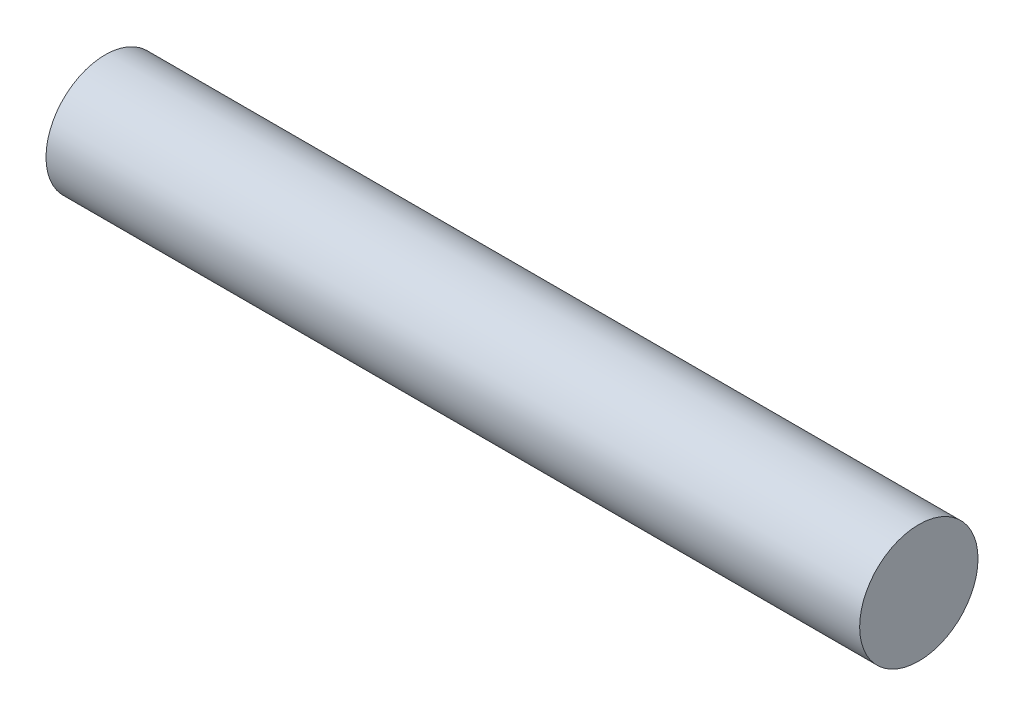
ISO-10303-21;
HEADER;
FILE_DESCRIPTION(('STEP AP214'),'2;1');
FILE_NAME('part.step','',(''),(''),'','','');
FILE_SCHEMA(('AUTOMOTIVE_DESIGN { 1 0 10303 214 1 1 1 1 }'));
ENDSEC;
DATA;
#1=APPLICATION_CONTEXT('core data for automotive mechanical design processes');
#2=APPLICATION_PROTOCOL_DEFINITION('international standard','automotive_design',2000,#1);
#3=PRODUCT_CONTEXT('',#1,'mechanical');
#4=PRODUCT('Part','Part','',(#3));
#5=PRODUCT_RELATED_PRODUCT_CATEGORY('part','',(#4));
#6=PRODUCT_DEFINITION_FORMATION('','',#4);
#7=PRODUCT_DEFINITION_CONTEXT('part definition',#1,'design');
#8=PRODUCT_DEFINITION('design','',#6,#7);
#9=PRODUCT_DEFINITION_SHAPE('','',#8);
#10=(LENGTH_UNIT() NAMED_UNIT(*) SI_UNIT(.MILLI.,.METRE.));
#11=(NAMED_UNIT(*) PLANE_ANGLE_UNIT() SI_UNIT($,.RADIAN.));
#12=(NAMED_UNIT(*) SI_UNIT($,.STERADIAN.) SOLID_ANGLE_UNIT());
#13=UNCERTAINTY_MEASURE_WITH_UNIT(LENGTH_MEASURE(1.E-05),#10,'distance_accuracy_value','');
#14=(GEOMETRIC_REPRESENTATION_CONTEXT(3) GLOBAL_UNCERTAINTY_ASSIGNED_CONTEXT((#13)) GLOBAL_UNIT_ASSIGNED_CONTEXT((#10,
#11,#12)) REPRESENTATION_CONTEXT('',''));
#15=CARTESIAN_POINT('',(0.,0.,0.));
#16=DIRECTION('',(0.,0.,1.));
#17=DIRECTION('',(1.,0.,0.));
#18=AXIS2_PLACEMENT_3D('',#15,#16,#17);
#19=CARTESIAN_POINT('',(36.75,0.,0.));
#20=DIRECTION('',(-1.,0.,0.));
#21=DIRECTION('',(0.,0.,1.));
#22=AXIS2_PLACEMENT_3D('',#19,#20,#21);
#23=CYLINDRICAL_SURFACE('',#22,3.);
#24=CARTESIAN_POINT('',(36.75,0.,0.));
#25=DIRECTION('',(1.,0.,0.));
#26=DIRECTION('',(0.,0.,-1.));
#27=AXIS2_PLACEMENT_3D('',#24,#25,#26);
#28=CIRCLE('',#27,3.);
#29=CARTESIAN_POINT('',(36.75,0.,-3.));
#30=VERTEX_POINT('',#29);
#31=EDGE_CURVE('E10',#30,#30,#28,.T.);
#32=ORIENTED_EDGE('',*,*,#31,.F.);
#33=EDGE_LOOP('',(#32));
#34=FACE_BOUND('',#33,.T.);
#35=CARTESIAN_POINT('',(-4.5,0.,0.));
#36=DIRECTION('',(-1.,0.,0.));
#37=DIRECTION('',(0.,0.,1.));
#38=AXIS2_PLACEMENT_3D('',#35,#36,#37);
#39=CIRCLE('',#38,3.);
#40=CARTESIAN_POINT('',(-4.5,0.,3.));
#41=VERTEX_POINT('',#40);
#42=EDGE_CURVE('E44',#41,#41,#39,.T.);
#43=ORIENTED_EDGE('',*,*,#42,.F.);
#44=EDGE_LOOP('',(#43));
#45=FACE_BOUND('',#44,.T.);
#46=ADVANCED_FACE('F37',(#34,#45),#23,.T.);
#47=CARTESIAN_POINT('',(36.75,0.,0.));
#48=DIRECTION('',(1.,0.,0.));
#49=DIRECTION('',(0.,0.,-1.));
#50=AXIS2_PLACEMENT_3D('',#47,#48,#49);
#51=PLANE('',#50);
#52=ORIENTED_EDGE('',*,*,#31,.T.);
#53=EDGE_LOOP('',(#52));
#54=FACE_BOUND('',#53,.T.);
#55=ADVANCED_FACE('F54',(#54),#51,.T.);
#56=CARTESIAN_POINT('',(-4.5,0.,0.));
#57=DIRECTION('',(-1.,0.,0.));
#58=DIRECTION('',(0.,0.,1.));
#59=AXIS2_PLACEMENT_3D('',#56,#57,#58);
#60=PLANE('',#59);
#61=ORIENTED_EDGE('',*,*,#42,.T.);
#62=EDGE_LOOP('',(#61));
#63=FACE_BOUND('',#62,.T.);
#64=ADVANCED_FACE('F51',(#63),#60,.T.);
#65=CLOSED_SHELL('',(#46,#55,#64));
#66=MANIFOLD_SOLID_BREP('B2',#65);
#67=ADVANCED_BREP_SHAPE_REPRESENTATION('',(#18,#66),#14);
#68=SHAPE_DEFINITION_REPRESENTATION(#9,#67);
ENDSEC;
END-ISO-10303-21;
